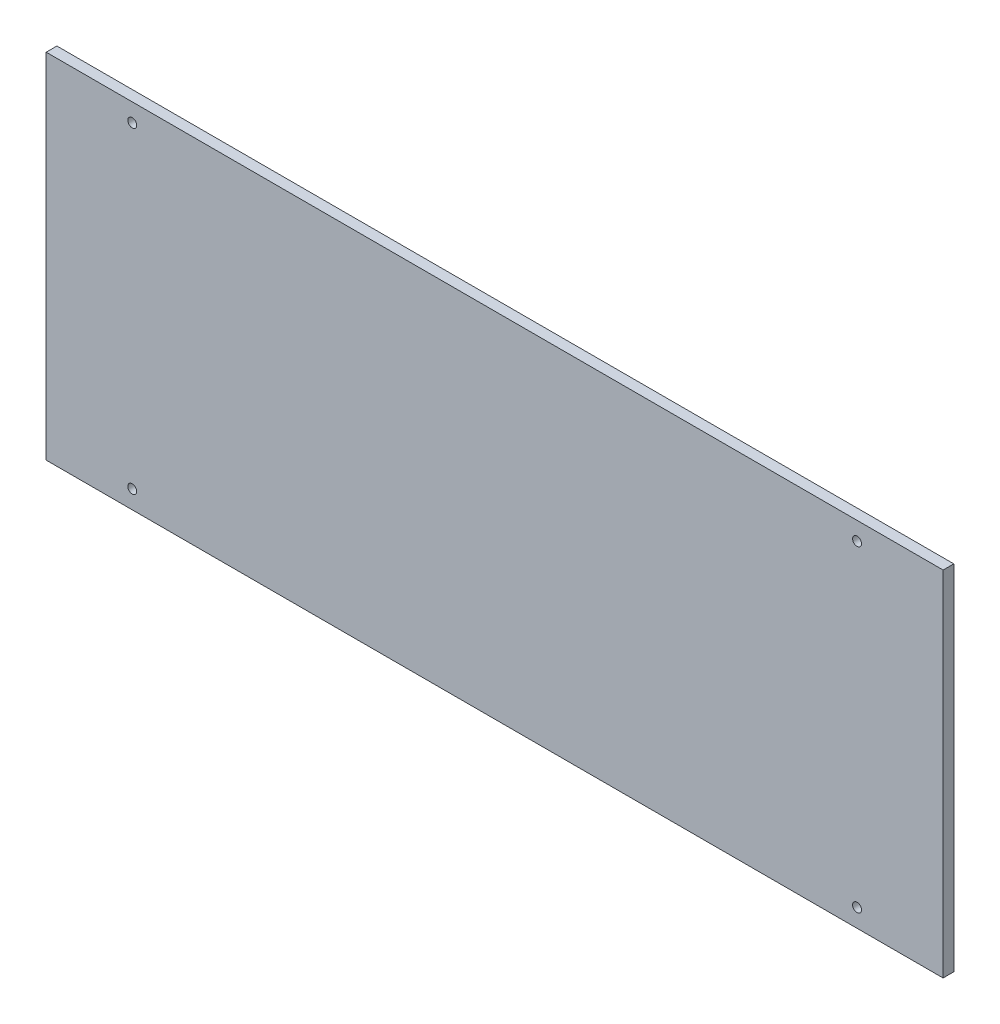
ISO-10303-21;
HEADER;
FILE_DESCRIPTION(('STEP AP214'),'2;1');
FILE_NAME('part.step','',(''),(''),'','','');
FILE_SCHEMA(('AUTOMOTIVE_DESIGN { 1 0 10303 214 1 1 1 1 }'));
ENDSEC;
DATA;
#1=APPLICATION_CONTEXT('core data for automotive mechanical design processes');
#2=APPLICATION_PROTOCOL_DEFINITION('international standard','automotive_design',2000,#1);
#3=PRODUCT_CONTEXT('',#1,'mechanical');
#4=PRODUCT('Part','Part','',(#3));
#5=PRODUCT_RELATED_PRODUCT_CATEGORY('part','',(#4));
#6=PRODUCT_DEFINITION_FORMATION('','',#4);
#7=PRODUCT_DEFINITION_CONTEXT('part definition',#1,'design');
#8=PRODUCT_DEFINITION('design','',#6,#7);
#9=PRODUCT_DEFINITION_SHAPE('','',#8);
#10=(LENGTH_UNIT() NAMED_UNIT(*) SI_UNIT(.MILLI.,.METRE.));
#11=(NAMED_UNIT(*) PLANE_ANGLE_UNIT() SI_UNIT($,.RADIAN.));
#12=(NAMED_UNIT(*) SI_UNIT($,.STERADIAN.) SOLID_ANGLE_UNIT());
#13=UNCERTAINTY_MEASURE_WITH_UNIT(LENGTH_MEASURE(1.E-05),#10,'distance_accuracy_value','');
#14=(GEOMETRIC_REPRESENTATION_CONTEXT(3) GLOBAL_UNCERTAINTY_ASSIGNED_CONTEXT((#13)) GLOBAL_UNIT_ASSIGNED_CONTEXT((#10,
#11,#12)) REPRESENTATION_CONTEXT('',''));
#15=CARTESIAN_POINT('',(0.,0.,0.));
#16=DIRECTION('',(0.,0.,1.));
#17=DIRECTION('',(1.,0.,0.));
#18=AXIS2_PLACEMENT_3D('',#15,#16,#17);
#19=CARTESIAN_POINT('',(0.,0.,3.));
#20=DIRECTION('',(0.,0.,-1.));
#21=DIRECTION('',(-1.,0.,0.));
#22=AXIS2_PLACEMENT_3D('',#19,#20,#21);
#23=PLANE('',#22);
#24=DIRECTION('',(0.,-1.,0.));
#25=VECTOR('',#24,1.);
#26=CARTESIAN_POINT('',(-125.73,49.53,3.));
#27=LINE('',#26,#25);
#28=CARTESIAN_POINT('',(-125.73,49.53,3.));
#29=VERTEX_POINT('',#28);
#30=CARTESIAN_POINT('',(-125.73,-49.53,3.));
#31=VERTEX_POINT('',#30);
#32=EDGE_CURVE('E93',#29,#31,#27,.T.);
#33=ORIENTED_EDGE('',*,*,#32,.T.);
#34=DIRECTION('',(1.,0.,0.));
#35=VECTOR('',#34,1.);
#36=CARTESIAN_POINT('',(125.73,-49.53,3.));
#37=LINE('',#36,#35);
#38=CARTESIAN_POINT('',(125.73,-49.53,3.));
#39=VERTEX_POINT('',#38);
#40=EDGE_CURVE('E88',#31,#39,#37,.T.);
#41=ORIENTED_EDGE('',*,*,#40,.T.);
#42=DIRECTION('',(0.,1.,0.));
#43=VECTOR('',#42,1.);
#44=CARTESIAN_POINT('',(125.73,49.53,3.));
#45=LINE('',#44,#43);
#46=CARTESIAN_POINT('',(125.73,49.53,3.));
#47=VERTEX_POINT('',#46);
#48=EDGE_CURVE('E91',#39,#47,#45,.T.);
#49=ORIENTED_EDGE('',*,*,#48,.T.);
#50=DIRECTION('',(-1.,0.,0.));
#51=VECTOR('',#50,1.);
#52=CARTESIAN_POINT('',(125.73,49.53,3.));
#53=LINE('',#52,#51);
#54=EDGE_CURVE('E58',#47,#29,#53,.T.);
#55=ORIENTED_EDGE('',*,*,#54,.T.);
#56=EDGE_LOOP('',(#33,#41,#49,#55));
#57=FACE_BOUND('',#56,.T.);
#58=CARTESIAN_POINT('',(101.6,44.45,3.));
#59=DIRECTION('',(0.,0.,1.));
#60=DIRECTION('',(1.,0.,0.));
#61=AXIS2_PLACEMENT_3D('',#58,#59,#60);
#62=CIRCLE('',#61,1.25);
#63=CARTESIAN_POINT('',(102.85,44.45,3.));
#64=VERTEX_POINT('',#63);
#65=EDGE_CURVE('E108',#64,#64,#62,.T.);
#66=ORIENTED_EDGE('',*,*,#65,.F.);
#67=EDGE_LOOP('',(#66));
#68=FACE_BOUND('',#67,.T.);
#69=CARTESIAN_POINT('',(-101.6,44.45,3.));
#70=DIRECTION('',(0.,0.,1.));
#71=DIRECTION('',(1.,0.,0.));
#72=AXIS2_PLACEMENT_3D('',#69,#70,#71);
#73=CIRCLE('',#72,1.25);
#74=CARTESIAN_POINT('',(-100.35,44.45,3.));
#75=VERTEX_POINT('',#74);
#76=EDGE_CURVE('E123',#75,#75,#73,.T.);
#77=ORIENTED_EDGE('',*,*,#76,.F.);
#78=EDGE_LOOP('',(#77));
#79=FACE_BOUND('',#78,.T.);
#80=CARTESIAN_POINT('',(101.6,-44.45,3.));
#81=DIRECTION('',(0.,0.,1.));
#82=DIRECTION('',(1.,0.,0.));
#83=AXIS2_PLACEMENT_3D('',#80,#81,#82);
#84=CIRCLE('',#83,1.25);
#85=CARTESIAN_POINT('',(102.85,-44.45,3.));
#86=VERTEX_POINT('',#85);
#87=EDGE_CURVE('E129',#86,#86,#84,.T.);
#88=ORIENTED_EDGE('',*,*,#87,.F.);
#89=EDGE_LOOP('',(#88));
#90=FACE_BOUND('',#89,.T.);
#91=CARTESIAN_POINT('',(-101.6,-44.45,3.));
#92=DIRECTION('',(0.,0.,1.));
#93=DIRECTION('',(1.,0.,0.));
#94=AXIS2_PLACEMENT_3D('',#91,#92,#93);
#95=CIRCLE('',#94,1.25);
#96=CARTESIAN_POINT('',(-100.35,-44.45,3.));
#97=VERTEX_POINT('',#96);
#98=EDGE_CURVE('E135',#97,#97,#95,.T.);
#99=ORIENTED_EDGE('',*,*,#98,.F.);
#100=EDGE_LOOP('',(#99));
#101=FACE_BOUND('',#100,.T.);
#102=ADVANCED_FACE('F41',(#57,#68,#79,#90,#101),#23,.F.);
#103=CARTESIAN_POINT('',(0.,0.,0.));
#104=DIRECTION('',(0.,0.,-1.));
#105=DIRECTION('',(-1.,0.,0.));
#106=AXIS2_PLACEMENT_3D('',#103,#104,#105);
#107=PLANE('',#106);
#108=CARTESIAN_POINT('',(101.6,-44.45,0.));
#109=DIRECTION('',(0.,0.,1.));
#110=DIRECTION('',(1.,0.,0.));
#111=AXIS2_PLACEMENT_3D('',#108,#109,#110);
#112=CIRCLE('',#111,1.25);
#113=CARTESIAN_POINT('',(102.85,-44.45,0.));
#114=VERTEX_POINT('',#113);
#115=EDGE_CURVE('E132',#114,#114,#112,.T.);
#116=ORIENTED_EDGE('',*,*,#115,.T.);
#117=EDGE_LOOP('',(#116));
#118=FACE_BOUND('',#117,.T.);
#119=CARTESIAN_POINT('',(101.6,44.45,0.));
#120=DIRECTION('',(0.,0.,1.));
#121=DIRECTION('',(1.,0.,0.));
#122=AXIS2_PLACEMENT_3D('',#119,#120,#121);
#123=CIRCLE('',#122,1.25);
#124=CARTESIAN_POINT('',(102.85,44.45,0.));
#125=VERTEX_POINT('',#124);
#126=EDGE_CURVE('E120',#125,#125,#123,.T.);
#127=ORIENTED_EDGE('',*,*,#126,.T.);
#128=EDGE_LOOP('',(#127));
#129=FACE_BOUND('',#128,.T.);
#130=DIRECTION('',(0.,-1.,0.));
#131=VECTOR('',#130,1.);
#132=CARTESIAN_POINT('',(-125.73,49.53,0.));
#133=LINE('',#132,#131);
#134=CARTESIAN_POINT('',(-125.73,49.53,0.));
#135=VERTEX_POINT('',#134);
#136=CARTESIAN_POINT('',(-125.73,-49.53,0.));
#137=VERTEX_POINT('',#136);
#138=EDGE_CURVE('E105',#135,#137,#133,.T.);
#139=ORIENTED_EDGE('',*,*,#138,.F.);
#140=DIRECTION('',(-1.,0.,0.));
#141=VECTOR('',#140,1.);
#142=CARTESIAN_POINT('',(125.73,49.53,0.));
#143=LINE('',#142,#141);
#144=CARTESIAN_POINT('',(125.73,49.53,0.));
#145=VERTEX_POINT('',#144);
#146=EDGE_CURVE('E81',#145,#135,#143,.T.);
#147=ORIENTED_EDGE('',*,*,#146,.F.);
#148=DIRECTION('',(0.,1.,0.));
#149=VECTOR('',#148,1.);
#150=CARTESIAN_POINT('',(125.73,49.53,0.));
#151=LINE('',#150,#149);
#152=CARTESIAN_POINT('',(125.73,-49.53,0.));
#153=VERTEX_POINT('',#152);
#154=EDGE_CURVE('E75',#153,#145,#151,.T.);
#155=ORIENTED_EDGE('',*,*,#154,.F.);
#156=DIRECTION('',(1.,0.,0.));
#157=VECTOR('',#156,1.);
#158=CARTESIAN_POINT('',(125.73,-49.53,0.));
#159=LINE('',#158,#157);
#160=EDGE_CURVE('E97',#137,#153,#159,.T.);
#161=ORIENTED_EDGE('',*,*,#160,.F.);
#162=EDGE_LOOP('',(#139,#147,#155,#161));
#163=FACE_BOUND('',#162,.T.);
#164=CARTESIAN_POINT('',(-101.6,44.45,0.));
#165=DIRECTION('',(0.,0.,1.));
#166=DIRECTION('',(1.,0.,0.));
#167=AXIS2_PLACEMENT_3D('',#164,#165,#166);
#168=CIRCLE('',#167,1.25);
#169=CARTESIAN_POINT('',(-100.35,44.45,0.));
#170=VERTEX_POINT('',#169);
#171=EDGE_CURVE('E126',#170,#170,#168,.T.);
#172=ORIENTED_EDGE('',*,*,#171,.T.);
#173=EDGE_LOOP('',(#172));
#174=FACE_BOUND('',#173,.T.);
#175=CARTESIAN_POINT('',(-101.6,-44.45,0.));
#176=DIRECTION('',(0.,0.,1.));
#177=DIRECTION('',(1.,0.,0.));
#178=AXIS2_PLACEMENT_3D('',#175,#176,#177);
#179=CIRCLE('',#178,1.25);
#180=CARTESIAN_POINT('',(-100.35,-44.45,0.));
#181=VERTEX_POINT('',#180);
#182=EDGE_CURVE('E138',#181,#181,#179,.T.);
#183=ORIENTED_EDGE('',*,*,#182,.T.);
#184=EDGE_LOOP('',(#183));
#185=FACE_BOUND('',#184,.T.);
#186=ADVANCED_FACE('F116',(#118,#129,#163,#174,#185),#107,.T.);
#187=CARTESIAN_POINT('',(-125.73,49.53,3.));
#188=DIRECTION('',(1.,0.,0.));
#189=DIRECTION('',(0.,0.,-1.));
#190=AXIS2_PLACEMENT_3D('',#187,#188,#189);
#191=PLANE('',#190);
#192=ORIENTED_EDGE('',*,*,#138,.T.);
#193=DIRECTION('',(0.,0.,-1.));
#194=VECTOR('',#193,1.);
#195=CARTESIAN_POINT('',(-125.73,-49.53,3.));
#196=LINE('',#195,#194);
#197=EDGE_CURVE('E11',#31,#137,#196,.T.);
#198=ORIENTED_EDGE('',*,*,#197,.F.);
#199=ORIENTED_EDGE('',*,*,#32,.F.);
#200=DIRECTION('',(0.,0.,-1.));
#201=VECTOR('',#200,1.);
#202=CARTESIAN_POINT('',(-125.73,49.53,3.));
#203=LINE('',#202,#201);
#204=EDGE_CURVE('E101',#29,#135,#203,.T.);
#205=ORIENTED_EDGE('',*,*,#204,.T.);
#206=EDGE_LOOP('',(#192,#198,#199,#205));
#207=FACE_BOUND('',#206,.T.);
#208=ADVANCED_FACE('F43',(#207),#191,.F.);
#209=CARTESIAN_POINT('',(125.73,-49.53,3.));
#210=DIRECTION('',(0.,1.,0.));
#211=DIRECTION('',(-1.,0.,0.));
#212=AXIS2_PLACEMENT_3D('',#209,#210,#211);
#213=PLANE('',#212);
#214=ORIENTED_EDGE('',*,*,#160,.T.);
#215=DIRECTION('',(0.,0.,-1.));
#216=VECTOR('',#215,1.);
#217=CARTESIAN_POINT('',(125.73,-49.53,3.));
#218=LINE('',#217,#216);
#219=EDGE_CURVE('E50',#39,#153,#218,.T.);
#220=ORIENTED_EDGE('',*,*,#219,.F.);
#221=ORIENTED_EDGE('',*,*,#40,.F.);
#222=ORIENTED_EDGE('',*,*,#197,.T.);
#223=EDGE_LOOP('',(#214,#220,#221,#222));
#224=FACE_BOUND('',#223,.T.);
#225=ADVANCED_FACE('F96',(#224),#213,.F.);
#226=CARTESIAN_POINT('',(125.73,49.53,3.));
#227=DIRECTION('',(-1.,0.,0.));
#228=DIRECTION('',(0.,-1.,0.));
#229=AXIS2_PLACEMENT_3D('',#226,#227,#228);
#230=PLANE('',#229);
#231=ORIENTED_EDGE('',*,*,#154,.T.);
#232=DIRECTION('',(0.,0.,-1.));
#233=VECTOR('',#232,1.);
#234=CARTESIAN_POINT('',(125.73,49.53,3.));
#235=LINE('',#234,#233);
#236=EDGE_CURVE('E98',#47,#145,#235,.T.);
#237=ORIENTED_EDGE('',*,*,#236,.F.);
#238=ORIENTED_EDGE('',*,*,#48,.F.);
#239=ORIENTED_EDGE('',*,*,#219,.T.);
#240=EDGE_LOOP('',(#231,#237,#238,#239));
#241=FACE_BOUND('',#240,.T.);
#242=ADVANCED_FACE('F99',(#241),#230,.F.);
#243=CARTESIAN_POINT('',(125.73,49.53,3.));
#244=DIRECTION('',(0.,-1.,0.));
#245=DIRECTION('',(1.,0.,0.));
#246=AXIS2_PLACEMENT_3D('',#243,#244,#245);
#247=PLANE('',#246);
#248=ORIENTED_EDGE('',*,*,#146,.T.);
#249=ORIENTED_EDGE('',*,*,#204,.F.);
#250=ORIENTED_EDGE('',*,*,#54,.F.);
#251=ORIENTED_EDGE('',*,*,#236,.T.);
#252=EDGE_LOOP('',(#248,#249,#250,#251));
#253=FACE_BOUND('',#252,.T.);
#254=ADVANCED_FACE('F113',(#253),#247,.F.);
#255=CARTESIAN_POINT('',(101.6,44.45,3.));
#256=DIRECTION('',(0.,0.,-1.));
#257=DIRECTION('',(-1.,0.,0.));
#258=AXIS2_PLACEMENT_3D('',#255,#256,#257);
#259=CYLINDRICAL_SURFACE('',#258,1.25);
#260=ORIENTED_EDGE('',*,*,#65,.T.);
#261=EDGE_LOOP('',(#260));
#262=FACE_BOUND('',#261,.T.);
#263=ORIENTED_EDGE('',*,*,#126,.F.);
#264=EDGE_LOOP('',(#263));
#265=FACE_BOUND('',#264,.T.);
#266=ADVANCED_FACE('F155',(#262,#265),#259,.F.);
#267=CARTESIAN_POINT('',(-101.6,44.45,3.));
#268=DIRECTION('',(0.,0.,-1.));
#269=DIRECTION('',(-1.,0.,0.));
#270=AXIS2_PLACEMENT_3D('',#267,#268,#269);
#271=CYLINDRICAL_SURFACE('',#270,1.25);
#272=ORIENTED_EDGE('',*,*,#76,.T.);
#273=EDGE_LOOP('',(#272));
#274=FACE_BOUND('',#273,.T.);
#275=ORIENTED_EDGE('',*,*,#171,.F.);
#276=EDGE_LOOP('',(#275));
#277=FACE_BOUND('',#276,.T.);
#278=ADVANCED_FACE('F209',(#274,#277),#271,.F.);
#279=CARTESIAN_POINT('',(101.6,-44.45,3.));
#280=DIRECTION('',(0.,0.,-1.));
#281=DIRECTION('',(-1.,0.,0.));
#282=AXIS2_PLACEMENT_3D('',#279,#280,#281);
#283=CYLINDRICAL_SURFACE('',#282,1.25);
#284=ORIENTED_EDGE('',*,*,#87,.T.);
#285=EDGE_LOOP('',(#284));
#286=FACE_BOUND('',#285,.T.);
#287=ORIENTED_EDGE('',*,*,#115,.F.);
#288=EDGE_LOOP('',(#287));
#289=FACE_BOUND('',#288,.T.);
#290=ADVANCED_FACE('F218',(#286,#289),#283,.F.);
#291=CARTESIAN_POINT('',(-101.6,-44.45,3.));
#292=DIRECTION('',(0.,0.,-1.));
#293=DIRECTION('',(-1.,0.,0.));
#294=AXIS2_PLACEMENT_3D('',#291,#292,#293);
#295=CYLINDRICAL_SURFACE('',#294,1.25);
#296=ORIENTED_EDGE('',*,*,#98,.T.);
#297=EDGE_LOOP('',(#296));
#298=FACE_BOUND('',#297,.T.);
#299=ORIENTED_EDGE('',*,*,#182,.F.);
#300=EDGE_LOOP('',(#299));
#301=FACE_BOUND('',#300,.T.);
#302=ADVANCED_FACE('F144',(#298,#301),#295,.F.);
#303=CLOSED_SHELL('',(#102,#186,#208,#225,#242,#254,#266,#278,#290,#302));
#304=MANIFOLD_SOLID_BREP('B2',#303);
#305=ADVANCED_BREP_SHAPE_REPRESENTATION('',(#18,#304),#14);
#306=SHAPE_DEFINITION_REPRESENTATION(#9,#305);
ENDSEC;
END-ISO-10303-21;
